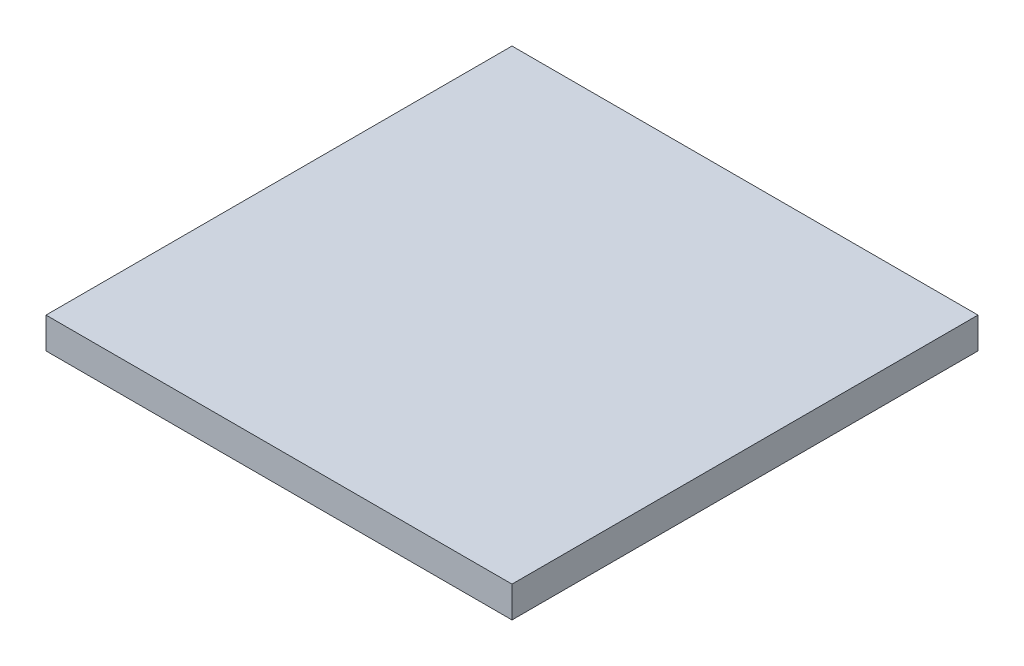
ISO-10303-21;
HEADER;
FILE_DESCRIPTION(('STEP AP214'),'2;1');
FILE_NAME('part.step','',(''),(''),'','','');
FILE_SCHEMA(('AUTOMOTIVE_DESIGN { 1 0 10303 214 1 1 1 1 }'));
ENDSEC;
DATA;
#1=APPLICATION_CONTEXT('core data for automotive mechanical design processes');
#2=APPLICATION_PROTOCOL_DEFINITION('international standard','automotive_design',2000,#1);
#3=PRODUCT_CONTEXT('',#1,'mechanical');
#4=PRODUCT('Part','Part','',(#3));
#5=PRODUCT_RELATED_PRODUCT_CATEGORY('part','',(#4));
#6=PRODUCT_DEFINITION_FORMATION('','',#4);
#7=PRODUCT_DEFINITION_CONTEXT('part definition',#1,'design');
#8=PRODUCT_DEFINITION('design','',#6,#7);
#9=PRODUCT_DEFINITION_SHAPE('','',#8);
#10=(LENGTH_UNIT() NAMED_UNIT(*) SI_UNIT(.MILLI.,.METRE.));
#11=(NAMED_UNIT(*) PLANE_ANGLE_UNIT() SI_UNIT($,.RADIAN.));
#12=(NAMED_UNIT(*) SI_UNIT($,.STERADIAN.) SOLID_ANGLE_UNIT());
#13=UNCERTAINTY_MEASURE_WITH_UNIT(LENGTH_MEASURE(1.E-05),#10,'distance_accuracy_value','');
#14=(GEOMETRIC_REPRESENTATION_CONTEXT(3) GLOBAL_UNCERTAINTY_ASSIGNED_CONTEXT((#13)) GLOBAL_UNIT_ASSIGNED_CONTEXT((#10,
#11,#12)) REPRESENTATION_CONTEXT('',''));
#15=CARTESIAN_POINT('',(0.,0.,0.));
#16=DIRECTION('',(0.,0.,1.));
#17=DIRECTION('',(1.,0.,0.));
#18=AXIS2_PLACEMENT_3D('',#15,#16,#17);
#19=CARTESIAN_POINT('',(0.,101.6,0.));
#20=DIRECTION('',(1.,0.,0.));
#21=DIRECTION('',(0.,0.,-1.));
#22=AXIS2_PLACEMENT_3D('',#19,#20,#21);
#23=PLANE('',#22);
#24=DIRECTION('',(0.,0.,1.));
#25=VECTOR('',#24,1.);
#26=CARTESIAN_POINT('',(0.,0.,0.));
#27=LINE('',#26,#25);
#28=CARTESIAN_POINT('',(0.,0.,-1524.));
#29=VERTEX_POINT('',#28);
#30=CARTESIAN_POINT('',(0.,0.,0.));
#31=VERTEX_POINT('',#30);
#32=EDGE_CURVE('E96',#29,#31,#27,.T.);
#33=ORIENTED_EDGE('',*,*,#32,.T.);
#34=DIRECTION('',(0.,-1.,0.));
#35=VECTOR('',#34,1.);
#36=CARTESIAN_POINT('',(0.,101.6,0.));
#37=LINE('',#36,#35);
#38=CARTESIAN_POINT('',(0.,101.6,0.));
#39=VERTEX_POINT('',#38);
#40=EDGE_CURVE('E11',#39,#31,#37,.T.);
#41=ORIENTED_EDGE('',*,*,#40,.F.);
#42=DIRECTION('',(0.,0.,1.));
#43=VECTOR('',#42,1.);
#44=CARTESIAN_POINT('',(0.,101.6,0.));
#45=LINE('',#44,#43);
#46=CARTESIAN_POINT('',(0.,101.6,-1524.));
#47=VERTEX_POINT('',#46);
#48=EDGE_CURVE('E84',#47,#39,#45,.T.);
#49=ORIENTED_EDGE('',*,*,#48,.F.);
#50=DIRECTION('',(0.,-1.,0.));
#51=VECTOR('',#50,1.);
#52=CARTESIAN_POINT('',(0.,101.6,-1524.));
#53=LINE('',#52,#51);
#54=EDGE_CURVE('E92',#47,#29,#53,.T.);
#55=ORIENTED_EDGE('',*,*,#54,.T.);
#56=EDGE_LOOP('',(#33,#41,#49,#55));
#57=FACE_BOUND('',#56,.T.);
#58=ADVANCED_FACE('F33',(#57),#23,.F.);
#59=CARTESIAN_POINT('',(0.,101.6,0.));
#60=DIRECTION('',(0.,0.,-1.));
#61=DIRECTION('',(-1.,0.,0.));
#62=AXIS2_PLACEMENT_3D('',#59,#60,#61);
#63=PLANE('',#62);
#64=DIRECTION('',(1.,0.,0.));
#65=VECTOR('',#64,1.);
#66=CARTESIAN_POINT('',(0.,0.,0.));
#67=LINE('',#66,#65);
#68=CARTESIAN_POINT('',(1524.,0.,0.));
#69=VERTEX_POINT('',#68);
#70=EDGE_CURVE('E88',#31,#69,#67,.T.);
#71=ORIENTED_EDGE('',*,*,#70,.T.);
#72=DIRECTION('',(0.,-1.,0.));
#73=VECTOR('',#72,1.);
#74=CARTESIAN_POINT('',(1524.,101.6,0.));
#75=LINE('',#74,#73);
#76=CARTESIAN_POINT('',(1524.,101.6,0.));
#77=VERTEX_POINT('',#76);
#78=EDGE_CURVE('E41',#77,#69,#75,.T.);
#79=ORIENTED_EDGE('',*,*,#78,.F.);
#80=DIRECTION('',(1.,0.,0.));
#81=VECTOR('',#80,1.);
#82=CARTESIAN_POINT('',(0.,101.6,0.));
#83=LINE('',#82,#81);
#84=EDGE_CURVE('E79',#39,#77,#83,.T.);
#85=ORIENTED_EDGE('',*,*,#84,.F.);
#86=ORIENTED_EDGE('',*,*,#40,.T.);
#87=EDGE_LOOP('',(#71,#79,#85,#86));
#88=FACE_BOUND('',#87,.T.);
#89=ADVANCED_FACE('F87',(#88),#63,.F.);
#90=CARTESIAN_POINT('',(1524.,101.6,0.));
#91=DIRECTION('',(-1.,0.,0.));
#92=DIRECTION('',(0.,0.,1.));
#93=AXIS2_PLACEMENT_3D('',#90,#91,#92);
#94=PLANE('',#93);
#95=DIRECTION('',(0.,0.,-1.));
#96=VECTOR('',#95,1.);
#97=CARTESIAN_POINT('',(1524.,0.,0.));
#98=LINE('',#97,#96);
#99=CARTESIAN_POINT('',(1524.,0.,-1524.));
#100=VERTEX_POINT('',#99);
#101=EDGE_CURVE('E66',#69,#100,#98,.T.);
#102=ORIENTED_EDGE('',*,*,#101,.T.);
#103=DIRECTION('',(0.,-1.,0.));
#104=VECTOR('',#103,1.);
#105=CARTESIAN_POINT('',(1524.,101.6,-1524.));
#106=LINE('',#105,#104);
#107=CARTESIAN_POINT('',(1524.,101.6,-1524.));
#108=VERTEX_POINT('',#107);
#109=EDGE_CURVE('E89',#108,#100,#106,.T.);
#110=ORIENTED_EDGE('',*,*,#109,.F.);
#111=DIRECTION('',(0.,0.,-1.));
#112=VECTOR('',#111,1.);
#113=CARTESIAN_POINT('',(1524.,101.6,0.));
#114=LINE('',#113,#112);
#115=EDGE_CURVE('E82',#77,#108,#114,.T.);
#116=ORIENTED_EDGE('',*,*,#115,.F.);
#117=ORIENTED_EDGE('',*,*,#78,.T.);
#118=EDGE_LOOP('',(#102,#110,#116,#117));
#119=FACE_BOUND('',#118,.T.);
#120=ADVANCED_FACE('F90',(#119),#94,.F.);
#121=CARTESIAN_POINT('',(0.,101.6,-1524.));
#122=DIRECTION('',(0.,0.,1.));
#123=DIRECTION('',(1.,0.,0.));
#124=AXIS2_PLACEMENT_3D('',#121,#122,#123);
#125=PLANE('',#124);
#126=DIRECTION('',(-1.,0.,0.));
#127=VECTOR('',#126,1.);
#128=CARTESIAN_POINT('',(0.,0.,-1524.));
#129=LINE('',#128,#127);
#130=EDGE_CURVE('E72',#100,#29,#129,.T.);
#131=ORIENTED_EDGE('',*,*,#130,.T.);
#132=ORIENTED_EDGE('',*,*,#54,.F.);
#133=DIRECTION('',(-1.,0.,0.));
#134=VECTOR('',#133,1.);
#135=CARTESIAN_POINT('',(0.,101.6,-1524.));
#136=LINE('',#135,#134);
#137=EDGE_CURVE('E49',#108,#47,#136,.T.);
#138=ORIENTED_EDGE('',*,*,#137,.F.);
#139=ORIENTED_EDGE('',*,*,#109,.T.);
#140=EDGE_LOOP('',(#131,#132,#138,#139));
#141=FACE_BOUND('',#140,.T.);
#142=ADVANCED_FACE('F103',(#141),#125,.F.);
#143=CARTESIAN_POINT('',(0.,101.6,0.));
#144=DIRECTION('',(0.,-1.,0.));
#145=DIRECTION('',(0.,0.,-1.));
#146=AXIS2_PLACEMENT_3D('',#143,#144,#145);
#147=PLANE('',#146);
#148=ORIENTED_EDGE('',*,*,#48,.T.);
#149=ORIENTED_EDGE('',*,*,#84,.T.);
#150=ORIENTED_EDGE('',*,*,#115,.T.);
#151=ORIENTED_EDGE('',*,*,#137,.T.);
#152=EDGE_LOOP('',(#148,#149,#150,#151));
#153=FACE_BOUND('',#152,.T.);
#154=ADVANCED_FACE('F80',(#153),#147,.F.);
#155=CARTESIAN_POINT('',(0.,0.,0.));
#156=DIRECTION('',(0.,-1.,0.));
#157=DIRECTION('',(0.,0.,-1.));
#158=AXIS2_PLACEMENT_3D('',#155,#156,#157);
#159=PLANE('',#158);
#160=ORIENTED_EDGE('',*,*,#32,.F.);
#161=ORIENTED_EDGE('',*,*,#130,.F.);
#162=ORIENTED_EDGE('',*,*,#101,.F.);
#163=ORIENTED_EDGE('',*,*,#70,.F.);
#164=EDGE_LOOP('',(#160,#161,#162,#163));
#165=FACE_BOUND('',#164,.T.);
#166=ADVANCED_FACE('F106',(#165),#159,.T.);
#167=CLOSED_SHELL('',(#58,#89,#120,#142,#154,#166));
#168=MANIFOLD_SOLID_BREP('B2',#167);
#169=ADVANCED_BREP_SHAPE_REPRESENTATION('',(#18,#168),#14);
#170=SHAPE_DEFINITION_REPRESENTATION(#9,#169);
ENDSEC;
END-ISO-10303-21;
